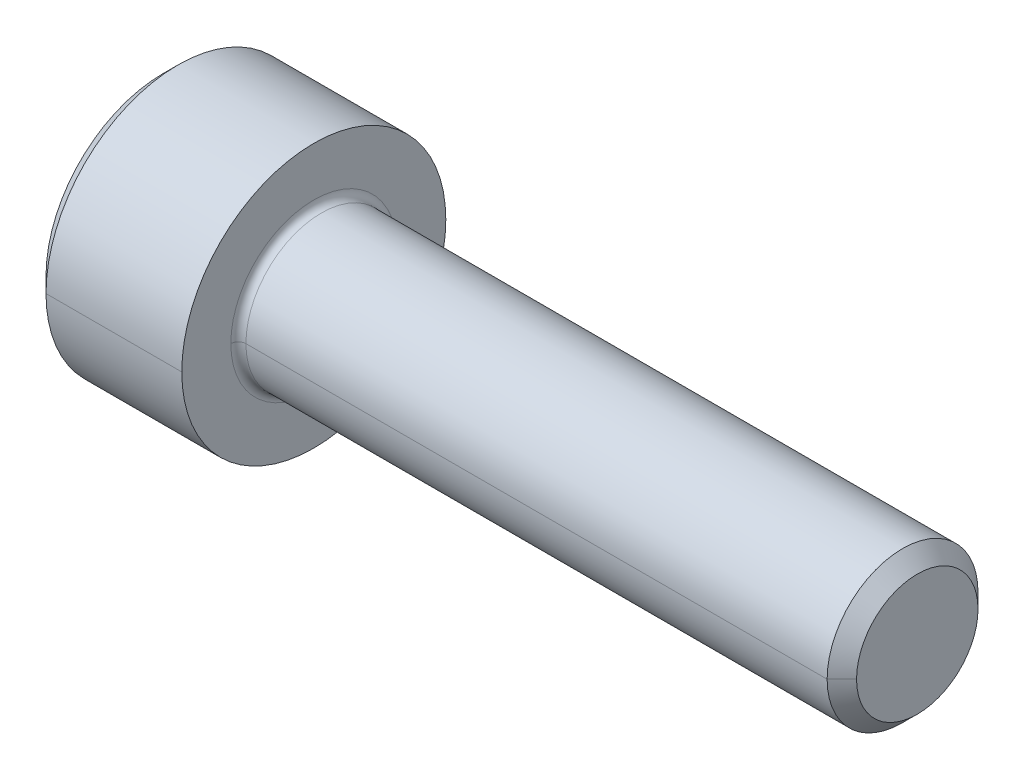
ISO-10303-21;
HEADER;
FILE_DESCRIPTION(('STEP AP214'),'2;1');
FILE_NAME('part.step','',(''),(''),'','','');
FILE_SCHEMA(('AUTOMOTIVE_DESIGN { 1 0 10303 214 1 1 1 1 }'));
ENDSEC;
DATA;
#1=APPLICATION_CONTEXT('core data for automotive mechanical design processes');
#2=APPLICATION_PROTOCOL_DEFINITION('international standard','automotive_design',2000,#1);
#3=PRODUCT_CONTEXT('',#1,'mechanical');
#4=PRODUCT('Part','Part','',(#3));
#5=PRODUCT_RELATED_PRODUCT_CATEGORY('part','',(#4));
#6=PRODUCT_DEFINITION_FORMATION('','',#4);
#7=PRODUCT_DEFINITION_CONTEXT('part definition',#1,'design');
#8=PRODUCT_DEFINITION('design','',#6,#7);
#9=PRODUCT_DEFINITION_SHAPE('','',#8);
#10=(LENGTH_UNIT() NAMED_UNIT(*) SI_UNIT(.MILLI.,.METRE.));
#11=(NAMED_UNIT(*) PLANE_ANGLE_UNIT() SI_UNIT($,.RADIAN.));
#12=(NAMED_UNIT(*) SI_UNIT($,.STERADIAN.) SOLID_ANGLE_UNIT());
#13=UNCERTAINTY_MEASURE_WITH_UNIT(LENGTH_MEASURE(1.E-05),#10,'distance_accuracy_value','');
#14=(GEOMETRIC_REPRESENTATION_CONTEXT(3) GLOBAL_UNCERTAINTY_ASSIGNED_CONTEXT((#13)) GLOBAL_UNIT_ASSIGNED_CONTEXT((#10,
#11,#12)) REPRESENTATION_CONTEXT('',''));
#15=CARTESIAN_POINT('',(0.,0.,0.));
#16=DIRECTION('',(0.,0.,1.));
#17=DIRECTION('',(1.,0.,0.));
#18=AXIS2_PLACEMENT_3D('',#15,#16,#17);
#19=CARTESIAN_POINT('',(2.,0.,0.));
#20=DIRECTION('',(-1.,0.,0.));
#21=DIRECTION('',(0.,0.,1.));
#22=AXIS2_PLACEMENT_3D('',#19,#20,#21);
#23=CONICAL_SURFACE('',#22,1.5355,1.0471975511966);
#24=DIRECTION('',(-0.5,0.,-0.866025403784436));
#25=VECTOR('',#24,1.);
#26=CARTESIAN_POINT('',(2.,0.,-1.5355));
#27=LINE('',#26,#25);
#28=CARTESIAN_POINT('',(2.88652133834068,0.,0.));
#29=VERTEX_POINT('',#28);
#30=CARTESIAN_POINT('',(2.,0.,-1.5355));
#31=VERTEX_POINT('',#30);
#32=EDGE_CURVE('E501',#29,#31,#27,.T.);
#33=ORIENTED_EDGE('',*,*,#32,.F.);
#34=DIRECTION('',(-0.5,0.,0.866025403784436));
#35=VECTOR('',#34,1.);
#36=CARTESIAN_POINT('',(2.,0.,1.5355));
#37=LINE('',#36,#35);
#38=CARTESIAN_POINT('',(2.,0.,1.5355));
#39=VERTEX_POINT('',#38);
#40=EDGE_CURVE('E505',#29,#39,#37,.T.);
#41=ORIENTED_EDGE('',*,*,#40,.T.);
#42=CARTESIAN_POINT('',(2.,0.,0.));
#43=DIRECTION('',(-1.,0.,0.));
#44=DIRECTION('',(0.,0.,1.));
#45=AXIS2_PLACEMENT_3D('',#42,#43,#44);
#46=CIRCLE('',#45,1.5355);
#47=CARTESIAN_POINT('',(2.,1.329782007511,0.76775));
#48=VERTEX_POINT('',#47);
#49=EDGE_CURVE('E228',#39,#48,#46,.T.);
#50=ORIENTED_EDGE('',*,*,#49,.T.);
#51=CARTESIAN_POINT('',(2.,0.,0.));
#52=DIRECTION('',(-1.,0.,0.));
#53=DIRECTION('',(0.,0.,1.));
#54=AXIS2_PLACEMENT_3D('',#51,#52,#53);
#55=CIRCLE('',#54,1.5355);
#56=CARTESIAN_POINT('',(2.,1.329782007511,-0.76775));
#57=VERTEX_POINT('',#56);
#58=EDGE_CURVE('E25',#48,#57,#55,.T.);
#59=ORIENTED_EDGE('',*,*,#58,.T.);
#60=CARTESIAN_POINT('',(2.,0.,0.));
#61=DIRECTION('',(-1.,0.,0.));
#62=DIRECTION('',(0.,0.,1.));
#63=AXIS2_PLACEMENT_3D('',#60,#61,#62);
#64=CIRCLE('',#63,1.5355);
#65=EDGE_CURVE('E11',#57,#31,#64,.T.);
#66=ORIENTED_EDGE('',*,*,#65,.T.);
#67=EDGE_LOOP('',(#33,#41,#50,#59,#66));
#68=FACE_BOUND('',#67,.T.);
#69=ADVANCED_FACE('F16',(#68),#23,.F.);
#70=CARTESIAN_POINT('',(2.,2.65956401502201,-1.5355));
#71=DIRECTION('',(1.,0.,0.));
#72=DIRECTION('',(0.,1.,0.));
#73=AXIS2_PLACEMENT_3D('',#70,#71,#72);
#74=PLANE('',#73);
#75=DIRECTION('',(0.,-0.5,-0.866025403784438));
#76=VECTOR('',#75,1.);
#77=CARTESIAN_POINT('',(2.,1.77304267668133,0.));
#78=LINE('',#77,#76);
#79=CARTESIAN_POINT('',(2.,0.886521338340665,-1.5355));
#80=VERTEX_POINT('',#79);
#81=EDGE_CURVE('E249',#57,#80,#78,.T.);
#82=ORIENTED_EDGE('',*,*,#81,.T.);
#83=DIRECTION('',(0.,-1.,0.));
#84=VECTOR('',#83,1.);
#85=CARTESIAN_POINT('',(2.,0.886521338340665,-1.5355));
#86=LINE('',#85,#84);
#87=EDGE_CURVE('E181',#80,#31,#86,.T.);
#88=ORIENTED_EDGE('',*,*,#87,.T.);
#89=ORIENTED_EDGE('',*,*,#65,.F.);
#90=EDGE_LOOP('',(#82,#88,#89));
#91=FACE_BOUND('',#90,.T.);
#92=ADVANCED_FACE('F331',(#91),#74,.F.);
#93=CARTESIAN_POINT('',(2.,2.65956401502201,-1.5355));
#94=DIRECTION('',(1.,0.,0.));
#95=DIRECTION('',(0.,1.,0.));
#96=AXIS2_PLACEMENT_3D('',#93,#94,#95);
#97=PLANE('',#96);
#98=DIRECTION('',(0.,-0.5,0.86602540378444));
#99=VECTOR('',#98,1.);
#100=CARTESIAN_POINT('',(2.,1.77304267668133,0.));
#101=LINE('',#100,#99);
#102=CARTESIAN_POINT('',(2.,1.77304267668133,0.));
#103=VERTEX_POINT('',#102);
#104=EDGE_CURVE('E195',#103,#48,#101,.T.);
#105=ORIENTED_EDGE('',*,*,#104,.F.);
#106=DIRECTION('',(0.,-0.5,-0.866025403784438));
#107=VECTOR('',#106,1.);
#108=CARTESIAN_POINT('',(2.,1.77304267668133,0.));
#109=LINE('',#108,#107);
#110=EDGE_CURVE('E231',#103,#57,#109,.T.);
#111=ORIENTED_EDGE('',*,*,#110,.T.);
#112=ORIENTED_EDGE('',*,*,#58,.F.);
#113=EDGE_LOOP('',(#105,#111,#112));
#114=FACE_BOUND('',#113,.T.);
#115=ADVANCED_FACE('F245',(#114),#97,.F.);
#116=CARTESIAN_POINT('',(2.,2.65956401502201,-1.5355));
#117=DIRECTION('',(1.,0.,0.));
#118=DIRECTION('',(0.,1.,0.));
#119=AXIS2_PLACEMENT_3D('',#116,#117,#118);
#120=PLANE('',#119);
#121=DIRECTION('',(0.,1.,0.));
#122=VECTOR('',#121,1.);
#123=CARTESIAN_POINT('',(2.,-0.886521338340671,1.5355));
#124=LINE('',#123,#122);
#125=CARTESIAN_POINT('',(2.,0.886521338340669,1.5355));
#126=VERTEX_POINT('',#125);
#127=EDGE_CURVE('E206',#39,#126,#124,.T.);
#128=ORIENTED_EDGE('',*,*,#127,.T.);
#129=DIRECTION('',(0.,-0.5,0.86602540378444));
#130=VECTOR('',#129,1.);
#131=CARTESIAN_POINT('',(2.,1.77304267668133,0.));
#132=LINE('',#131,#130);
#133=EDGE_CURVE('E199',#48,#126,#132,.T.);
#134=ORIENTED_EDGE('',*,*,#133,.F.);
#135=ORIENTED_EDGE('',*,*,#49,.F.);
#136=EDGE_LOOP('',(#128,#134,#135));
#137=FACE_BOUND('',#136,.T.);
#138=ADVANCED_FACE('F340',(#137),#120,.F.);
#139=CARTESIAN_POINT('',(2.,2.65956401502201,-1.5355));
#140=DIRECTION('',(1.,0.,0.));
#141=DIRECTION('',(0.,1.,0.));
#142=AXIS2_PLACEMENT_3D('',#139,#140,#141);
#143=PLANE('',#142);
#144=DIRECTION('',(0.,-0.5,-0.866025403784438));
#145=VECTOR('',#144,1.);
#146=CARTESIAN_POINT('',(2.,-0.886521338340671,1.5355));
#147=LINE('',#146,#145);
#148=CARTESIAN_POINT('',(2.,-0.886521338340671,1.5355));
#149=VERTEX_POINT('',#148);
#150=CARTESIAN_POINT('',(2.,-1.32978200751101,0.76775));
#151=VERTEX_POINT('',#150);
#152=EDGE_CURVE('E216',#149,#151,#147,.T.);
#153=ORIENTED_EDGE('',*,*,#152,.F.);
#154=DIRECTION('',(0.,1.,0.));
#155=VECTOR('',#154,1.);
#156=CARTESIAN_POINT('',(2.,-0.886521338340671,1.5355));
#157=LINE('',#156,#155);
#158=EDGE_CURVE('E207',#149,#39,#157,.T.);
#159=ORIENTED_EDGE('',*,*,#158,.T.);
#160=CARTESIAN_POINT('',(2.,0.,0.));
#161=DIRECTION('',(-1.,0.,0.));
#162=DIRECTION('',(0.,0.,1.));
#163=AXIS2_PLACEMENT_3D('',#160,#161,#162);
#164=CIRCLE('',#163,1.5355);
#165=EDGE_CURVE('E486',#151,#39,#164,.T.);
#166=ORIENTED_EDGE('',*,*,#165,.F.);
#167=EDGE_LOOP('',(#153,#159,#166));
#168=FACE_BOUND('',#167,.T.);
#169=ADVANCED_FACE('F345',(#168),#143,.F.);
#170=CARTESIAN_POINT('',(2.,2.65956401502201,-1.5355));
#171=DIRECTION('',(1.,0.,0.));
#172=DIRECTION('',(0.,1.,0.));
#173=AXIS2_PLACEMENT_3D('',#170,#171,#172);
#174=PLANE('',#173);
#175=DIRECTION('',(0.,0.5,-0.86602540378444));
#176=VECTOR('',#175,1.);
#177=CARTESIAN_POINT('',(2.,-1.77304267668134,0.));
#178=LINE('',#177,#176);
#179=CARTESIAN_POINT('',(2.,-1.77304267668134,0.));
#180=VERTEX_POINT('',#179);
#181=CARTESIAN_POINT('',(2.,-1.32978200751101,-0.76775));
#182=VERTEX_POINT('',#181);
#183=EDGE_CURVE('E88',#180,#182,#178,.T.);
#184=ORIENTED_EDGE('',*,*,#183,.F.);
#185=DIRECTION('',(0.,-0.5,-0.866025403784438));
#186=VECTOR('',#185,1.);
#187=CARTESIAN_POINT('',(2.,-0.886521338340671,1.5355));
#188=LINE('',#187,#186);
#189=EDGE_CURVE('E145',#151,#180,#188,.T.);
#190=ORIENTED_EDGE('',*,*,#189,.F.);
#191=CARTESIAN_POINT('',(2.,0.,0.));
#192=DIRECTION('',(-1.,0.,0.));
#193=DIRECTION('',(0.,0.,1.));
#194=AXIS2_PLACEMENT_3D('',#191,#192,#193);
#195=CIRCLE('',#194,1.5355);
#196=EDGE_CURVE('E494',#182,#151,#195,.T.);
#197=ORIENTED_EDGE('',*,*,#196,.F.);
#198=EDGE_LOOP('',(#184,#190,#197));
#199=FACE_BOUND('',#198,.T.);
#200=ADVANCED_FACE('F349',(#199),#174,.F.);
#201=CARTESIAN_POINT('',(2.,2.65956401502201,-1.5355));
#202=DIRECTION('',(1.,0.,0.));
#203=DIRECTION('',(0.,1.,0.));
#204=AXIS2_PLACEMENT_3D('',#201,#202,#203);
#205=PLANE('',#204);
#206=DIRECTION('',(0.,-1.,0.));
#207=VECTOR('',#206,1.);
#208=CARTESIAN_POINT('',(2.,0.886521338340665,-1.5355));
#209=LINE('',#208,#207);
#210=CARTESIAN_POINT('',(2.,-0.886521338340676,-1.5355));
#211=VERTEX_POINT('',#210);
#212=EDGE_CURVE('E75',#31,#211,#209,.T.);
#213=ORIENTED_EDGE('',*,*,#212,.T.);
#214=DIRECTION('',(0.,0.5,-0.86602540378444));
#215=VECTOR('',#214,1.);
#216=CARTESIAN_POINT('',(2.,-1.77304267668134,0.));
#217=LINE('',#216,#215);
#218=EDGE_CURVE('E223',#182,#211,#217,.T.);
#219=ORIENTED_EDGE('',*,*,#218,.F.);
#220=CARTESIAN_POINT('',(2.,0.,0.));
#221=DIRECTION('',(-1.,0.,0.));
#222=DIRECTION('',(0.,0.,1.));
#223=AXIS2_PLACEMENT_3D('',#220,#221,#222);
#224=CIRCLE('',#223,1.5355);
#225=EDGE_CURVE('E497',#31,#182,#224,.T.);
#226=ORIENTED_EDGE('',*,*,#225,.F.);
#227=EDGE_LOOP('',(#213,#219,#226));
#228=FACE_BOUND('',#227,.T.);
#229=ADVANCED_FACE('F353',(#228),#205,.F.);
#230=CARTESIAN_POINT('',(2.,1.77304267668133,0.));
#231=DIRECTION('',(0.,0.866025403784438,-0.5));
#232=DIRECTION('',(-1.,0.,0.));
#233=AXIS2_PLACEMENT_3D('',#230,#231,#232);
#234=PLANE('',#233);
#235=DIRECTION('',(0.,-0.5,-0.866025403784438));
#236=VECTOR('',#235,1.);
#237=CARTESIAN_POINT('',(0.,1.77304267668133,0.));
#238=LINE('',#237,#236);
#239=CARTESIAN_POINT('',(0.,1.77304267668133,0.));
#240=VERTEX_POINT('',#239);
#241=CARTESIAN_POINT('',(0.,0.886521338340665,-1.5355));
#242=VERTEX_POINT('',#241);
#243=EDGE_CURVE('E177',#240,#242,#238,.T.);
#244=ORIENTED_EDGE('',*,*,#243,.T.);
#245=DIRECTION('',(-1.,0.,0.));
#246=VECTOR('',#245,1.);
#247=CARTESIAN_POINT('',(2.,0.886521338340665,-1.5355));
#248=LINE('',#247,#246);
#249=EDGE_CURVE('E213',#80,#242,#248,.T.);
#250=ORIENTED_EDGE('',*,*,#249,.F.);
#251=ORIENTED_EDGE('',*,*,#81,.F.);
#252=ORIENTED_EDGE('',*,*,#110,.F.);
#253=DIRECTION('',(-1.,0.,0.));
#254=VECTOR('',#253,1.);
#255=CARTESIAN_POINT('',(2.,1.77304267668133,0.));
#256=LINE('',#255,#254);
#257=EDGE_CURVE('E192',#103,#240,#256,.T.);
#258=ORIENTED_EDGE('',*,*,#257,.T.);
#259=EDGE_LOOP('',(#244,#250,#251,#252,#258));
#260=FACE_BOUND('',#259,.T.);
#261=ADVANCED_FACE('F253',(#260),#234,.F.);
#262=CARTESIAN_POINT('',(2.,0.886521338340665,-1.5355));
#263=DIRECTION('',(0.,0.,-1.));
#264=DIRECTION('',(0.,-1.,0.));
#265=AXIS2_PLACEMENT_3D('',#262,#263,#264);
#266=PLANE('',#265);
#267=DIRECTION('',(0.,-1.,0.));
#268=VECTOR('',#267,1.);
#269=CARTESIAN_POINT('',(0.,0.886521338340665,-1.5355));
#270=LINE('',#269,#268);
#271=CARTESIAN_POINT('',(0.,-0.886521338340676,-1.5355));
#272=VERTEX_POINT('',#271);
#273=EDGE_CURVE('E158',#242,#272,#270,.T.);
#274=ORIENTED_EDGE('',*,*,#273,.T.);
#275=DIRECTION('',(-1.,0.,0.));
#276=VECTOR('',#275,1.);
#277=CARTESIAN_POINT('',(2.,-0.886521338340676,-1.5355));
#278=LINE('',#277,#276);
#279=EDGE_CURVE('E153',#211,#272,#278,.T.);
#280=ORIENTED_EDGE('',*,*,#279,.F.);
#281=ORIENTED_EDGE('',*,*,#212,.F.);
#282=ORIENTED_EDGE('',*,*,#87,.F.);
#283=ORIENTED_EDGE('',*,*,#249,.T.);
#284=EDGE_LOOP('',(#274,#280,#281,#282,#283));
#285=FACE_BOUND('',#284,.T.);
#286=ADVANCED_FACE('F356',(#285),#266,.F.);
#287=CARTESIAN_POINT('',(2.,-1.77304267668134,0.));
#288=DIRECTION('',(0.,0.86602540378444,0.5));
#289=DIRECTION('',(1.,0.,0.));
#290=AXIS2_PLACEMENT_3D('',#287,#288,#289);
#291=PLANE('',#290);
#292=DIRECTION('',(0.,0.5,-0.86602540378444));
#293=VECTOR('',#292,1.);
#294=CARTESIAN_POINT('',(0.,-1.77304267668134,0.));
#295=LINE('',#294,#293);
#296=CARTESIAN_POINT('',(0.,-1.77304267668134,0.));
#297=VERTEX_POINT('',#296);
#298=EDGE_CURVE('E150',#297,#272,#295,.T.);
#299=ORIENTED_EDGE('',*,*,#298,.F.);
#300=DIRECTION('',(-1.,0.,0.));
#301=VECTOR('',#300,1.);
#302=CARTESIAN_POINT('',(2.,-1.77304267668134,0.));
#303=LINE('',#302,#301);
#304=EDGE_CURVE('E138',#180,#297,#303,.T.);
#305=ORIENTED_EDGE('',*,*,#304,.F.);
#306=ORIENTED_EDGE('',*,*,#183,.T.);
#307=ORIENTED_EDGE('',*,*,#218,.T.);
#308=ORIENTED_EDGE('',*,*,#279,.T.);
#309=EDGE_LOOP('',(#299,#305,#306,#307,#308));
#310=FACE_BOUND('',#309,.T.);
#311=ADVANCED_FACE('F151',(#310),#291,.T.);
#312=CARTESIAN_POINT('',(2.,-0.886521338340671,1.5355));
#313=DIRECTION('',(0.,0.866025403784438,-0.5));
#314=DIRECTION('',(-1.,0.,0.));
#315=AXIS2_PLACEMENT_3D('',#312,#313,#314);
#316=PLANE('',#315);
#317=DIRECTION('',(0.,-0.5,-0.866025403784438));
#318=VECTOR('',#317,1.);
#319=CARTESIAN_POINT('',(0.,-0.886521338340671,1.5355));
#320=LINE('',#319,#318);
#321=CARTESIAN_POINT('',(0.,-0.886521338340671,1.5355));
#322=VERTEX_POINT('',#321);
#323=EDGE_CURVE('E142',#322,#297,#320,.T.);
#324=ORIENTED_EDGE('',*,*,#323,.F.);
#325=DIRECTION('',(-1.,0.,0.));
#326=VECTOR('',#325,1.);
#327=CARTESIAN_POINT('',(2.,-0.886521338340671,1.5355));
#328=LINE('',#327,#326);
#329=EDGE_CURVE('E131',#149,#322,#328,.T.);
#330=ORIENTED_EDGE('',*,*,#329,.F.);
#331=ORIENTED_EDGE('',*,*,#152,.T.);
#332=ORIENTED_EDGE('',*,*,#189,.T.);
#333=ORIENTED_EDGE('',*,*,#304,.T.);
#334=EDGE_LOOP('',(#324,#330,#331,#332,#333));
#335=FACE_BOUND('',#334,.T.);
#336=ADVANCED_FACE('F140',(#335),#316,.T.);
#337=CARTESIAN_POINT('',(2.,-0.886521338340671,1.5355));
#338=DIRECTION('',(0.,0.,1.));
#339=DIRECTION('',(0.,-1.,0.));
#340=AXIS2_PLACEMENT_3D('',#337,#338,#339);
#341=PLANE('',#340);
#342=DIRECTION('',(0.,1.,0.));
#343=VECTOR('',#342,1.);
#344=CARTESIAN_POINT('',(0.,-0.886521338340671,1.5355));
#345=LINE('',#344,#343);
#346=CARTESIAN_POINT('',(0.,0.886521338340669,1.5355));
#347=VERTEX_POINT('',#346);
#348=EDGE_CURVE('E163',#322,#347,#345,.T.);
#349=ORIENTED_EDGE('',*,*,#348,.T.);
#350=DIRECTION('',(-1.,0.,0.));
#351=VECTOR('',#350,1.);
#352=CARTESIAN_POINT('',(2.,0.886521338340669,1.5355));
#353=LINE('',#352,#351);
#354=EDGE_CURVE('E203',#126,#347,#353,.T.);
#355=ORIENTED_EDGE('',*,*,#354,.F.);
#356=ORIENTED_EDGE('',*,*,#127,.F.);
#357=ORIENTED_EDGE('',*,*,#158,.F.);
#358=ORIENTED_EDGE('',*,*,#329,.T.);
#359=EDGE_LOOP('',(#349,#355,#356,#357,#358));
#360=FACE_BOUND('',#359,.T.);
#361=ADVANCED_FACE('F316',(#360),#341,.F.);
#362=CARTESIAN_POINT('',(2.,1.77304267668133,0.));
#363=DIRECTION('',(0.,-0.86602540378444,-0.5));
#364=DIRECTION('',(0.,0.5,-0.86602540378444));
#365=AXIS2_PLACEMENT_3D('',#362,#363,#364);
#366=PLANE('',#365);
#367=DIRECTION('',(0.,-0.5,0.86602540378444));
#368=VECTOR('',#367,1.);
#369=CARTESIAN_POINT('',(0.,1.77304267668133,0.));
#370=LINE('',#369,#368);
#371=EDGE_CURVE('E170',#240,#347,#370,.T.);
#372=ORIENTED_EDGE('',*,*,#371,.F.);
#373=ORIENTED_EDGE('',*,*,#257,.F.);
#374=ORIENTED_EDGE('',*,*,#104,.T.);
#375=ORIENTED_EDGE('',*,*,#133,.T.);
#376=ORIENTED_EDGE('',*,*,#354,.T.);
#377=EDGE_LOOP('',(#372,#373,#374,#375,#376));
#378=FACE_BOUND('',#377,.T.);
#379=ADVANCED_FACE('F313',(#378),#366,.T.);
#380=CARTESIAN_POINT('',(4.2,0.,0.));
#381=DIRECTION('',(1.,0.,0.));
#382=DIRECTION('',(0.,0.,-1.));
#383=AXIS2_PLACEMENT_3D('',#380,#381,#382);
#384=TOROIDAL_SURFACE('',#383,2.19999999999997,0.2);
#385=CARTESIAN_POINT('',(4.2,0.,2.19999999999997));
#386=DIRECTION('',(0.,1.,0.));
#387=DIRECTION('',(0.,0.,1.));
#388=AXIS2_PLACEMENT_3D('',#385,#386,#387);
#389=CIRCLE('',#388,0.2);
#390=CARTESIAN_POINT('',(4.2,0.,1.99999999999997));
#391=VERTEX_POINT('',#390);
#392=CARTESIAN_POINT('',(4.,0.,2.19999999999997));
#393=VERTEX_POINT('',#392);
#394=EDGE_CURVE('E477',#391,#393,#389,.T.);
#395=ORIENTED_EDGE('',*,*,#394,.F.);
#396=CARTESIAN_POINT('',(4.2,0.,0.));
#397=DIRECTION('',(1.,0.,0.));
#398=DIRECTION('',(0.,0.,-1.));
#399=AXIS2_PLACEMENT_3D('',#396,#397,#398);
#400=CIRCLE('',#399,1.99999999999997);
#401=CARTESIAN_POINT('',(4.2,0.,-1.99999999999997));
#402=VERTEX_POINT('',#401);
#403=EDGE_CURVE('E279',#402,#391,#400,.T.);
#404=ORIENTED_EDGE('',*,*,#403,.F.);
#405=CARTESIAN_POINT('',(4.2,0.,-2.19999999999997));
#406=DIRECTION('',(0.,-1.,0.));
#407=DIRECTION('',(0.,0.,-1.));
#408=AXIS2_PLACEMENT_3D('',#405,#406,#407);
#409=CIRCLE('',#408,0.2);
#410=CARTESIAN_POINT('',(4.,0.,-2.19999999999997));
#411=VERTEX_POINT('',#410);
#412=EDGE_CURVE('E465',#402,#411,#409,.T.);
#413=ORIENTED_EDGE('',*,*,#412,.T.);
#414=CARTESIAN_POINT('',(4.,0.,0.));
#415=DIRECTION('',(-1.,0.,0.));
#416=DIRECTION('',(0.,0.,-1.));
#417=AXIS2_PLACEMENT_3D('',#414,#415,#416);
#418=CIRCLE('',#417,2.19999999999997);
#419=EDGE_CURVE('E187',#393,#411,#418,.T.);
#420=ORIENTED_EDGE('',*,*,#419,.F.);
#421=EDGE_LOOP('',(#395,#404,#413,#420));
#422=FACE_BOUND('',#421,.T.);
#423=ADVANCED_FACE('F325',(#422),#384,.F.);
#424=CARTESIAN_POINT('',(0.,0.,0.));
#425=DIRECTION('',(1.,0.,0.));
#426=DIRECTION('',(0.,0.,-1.));
#427=AXIS2_PLACEMENT_3D('',#424,#425,#426);
#428=CONICAL_SURFACE('',#427,3.1,0.78539816339745);
#429=DIRECTION('',(0.707106781186546,0.,0.707106781186549));
#430=VECTOR('',#429,1.);
#431=CARTESIAN_POINT('',(0.,0.,3.1));
#432=LINE('',#431,#430);
#433=CARTESIAN_POINT('',(0.,0.,3.1));
#434=VERTEX_POINT('',#433);
#435=CARTESIAN_POINT('',(0.4,0.,3.5));
#436=VERTEX_POINT('',#435);
#437=EDGE_CURVE('E456',#434,#436,#432,.T.);
#438=ORIENTED_EDGE('',*,*,#437,.F.);
#439=CARTESIAN_POINT('',(0.,0.,0.));
#440=DIRECTION('',(-1.,0.,0.));
#441=DIRECTION('',(0.,0.,1.));
#442=AXIS2_PLACEMENT_3D('',#439,#440,#441);
#443=CIRCLE('',#442,3.1);
#444=CARTESIAN_POINT('',(0.,0.,-3.1));
#445=VERTEX_POINT('',#444);
#446=EDGE_CURVE('E303',#445,#434,#443,.T.);
#447=ORIENTED_EDGE('',*,*,#446,.F.);
#448=DIRECTION('',(0.707106781186546,0.,-0.707106781186549));
#449=VECTOR('',#448,1.);
#450=CARTESIAN_POINT('',(0.,0.,-3.1));
#451=LINE('',#450,#449);
#452=CARTESIAN_POINT('',(0.4,0.,-3.5));
#453=VERTEX_POINT('',#452);
#454=EDGE_CURVE('E269',#445,#453,#451,.T.);
#455=ORIENTED_EDGE('',*,*,#454,.T.);
#456=CARTESIAN_POINT('',(0.4,0.,0.));
#457=DIRECTION('',(-1.,0.,0.));
#458=DIRECTION('',(0.,0.,1.));
#459=AXIS2_PLACEMENT_3D('',#456,#457,#458);
#460=CIRCLE('',#459,3.5);
#461=EDGE_CURVE('E188',#453,#436,#460,.T.);
#462=ORIENTED_EDGE('',*,*,#461,.T.);
#463=EDGE_LOOP('',(#438,#447,#455,#462));
#464=FACE_BOUND('',#463,.T.);
#465=ADVANCED_FACE('F365',(#464),#428,.T.);
#466=CARTESIAN_POINT('',(-31.75,0.,0.));
#467=DIRECTION('',(-1.,0.,0.));
#468=DIRECTION('',(0.,0.,1.));
#469=AXIS2_PLACEMENT_3D('',#466,#467,#468);
#470=CYLINDRICAL_SURFACE('',#469,3.5);
#471=DIRECTION('',(-1.,0.,0.));
#472=VECTOR('',#471,1.);
#473=CARTESIAN_POINT('',(-31.75,0.,-3.5));
#474=LINE('',#473,#472);
#475=CARTESIAN_POINT('',(4.,0.,-3.5));
#476=VERTEX_POINT('',#475);
#477=EDGE_CURVE('E263',#476,#453,#474,.T.);
#478=ORIENTED_EDGE('',*,*,#477,.F.);
#479=CARTESIAN_POINT('',(4.,0.,0.));
#480=DIRECTION('',(-1.,0.,0.));
#481=DIRECTION('',(0.,0.,1.));
#482=AXIS2_PLACEMENT_3D('',#479,#480,#481);
#483=CIRCLE('',#482,3.5);
#484=CARTESIAN_POINT('',(4.,0.,3.5));
#485=VERTEX_POINT('',#484);
#486=EDGE_CURVE('E184',#476,#485,#483,.T.);
#487=ORIENTED_EDGE('',*,*,#486,.T.);
#488=DIRECTION('',(-1.,0.,0.));
#489=VECTOR('',#488,1.);
#490=CARTESIAN_POINT('',(-31.75,0.,3.5));
#491=LINE('',#490,#489);
#492=EDGE_CURVE('E270',#485,#436,#491,.T.);
#493=ORIENTED_EDGE('',*,*,#492,.T.);
#494=ORIENTED_EDGE('',*,*,#461,.F.);
#495=EDGE_LOOP('',(#478,#487,#493,#494));
#496=FACE_BOUND('',#495,.T.);
#497=ADVANCED_FACE('F368',(#496),#470,.T.);
#498=CARTESIAN_POINT('',(4.,3.5,0.));
#499=DIRECTION('',(1.,0.,0.));
#500=DIRECTION('',(0.,1.,0.));
#501=AXIS2_PLACEMENT_3D('',#498,#499,#500);
#502=PLANE('',#501);
#503=CARTESIAN_POINT('',(4.,0.,0.));
#504=DIRECTION('',(-1.,0.,0.));
#505=DIRECTION('',(0.,0.,-1.));
#506=AXIS2_PLACEMENT_3D('',#503,#504,#505);
#507=CIRCLE('',#506,2.19999999999997);
#508=EDGE_CURVE('E472',#411,#393,#507,.T.);
#509=ORIENTED_EDGE('',*,*,#508,.T.);
#510=ORIENTED_EDGE('',*,*,#419,.T.);
#511=EDGE_LOOP('',(#509,#510));
#512=FACE_BOUND('',#511,.T.);
#513=CARTESIAN_POINT('',(4.,0.,0.));
#514=DIRECTION('',(-1.,0.,0.));
#515=DIRECTION('',(0.,0.,1.));
#516=AXIS2_PLACEMENT_3D('',#513,#514,#515);
#517=CIRCLE('',#516,3.5);
#518=EDGE_CURVE('E265',#485,#476,#517,.T.);
#519=ORIENTED_EDGE('',*,*,#518,.F.);
#520=ORIENTED_EDGE('',*,*,#486,.F.);
#521=EDGE_LOOP('',(#519,#520));
#522=FACE_BOUND('',#521,.T.);
#523=ADVANCED_FACE('F371',(#512,#522),#502,.T.);
#524=CARTESIAN_POINT('',(-31.75,0.,0.));
#525=DIRECTION('',(-1.,0.,0.));
#526=DIRECTION('',(0.,0.,1.));
#527=AXIS2_PLACEMENT_3D('',#524,#525,#526);
#528=CYLINDRICAL_SURFACE('',#527,1.99999999999997);
#529=DIRECTION('',(-1.,0.,0.));
#530=VECTOR('',#529,1.);
#531=CARTESIAN_POINT('',(-31.75,0.,-1.99999999999997));
#532=LINE('',#531,#530);
#533=CARTESIAN_POINT('',(19.61,0.,-1.99999999999994));
#534=VERTEX_POINT('',#533);
#535=EDGE_CURVE('E275',#534,#402,#532,.T.);
#536=ORIENTED_EDGE('',*,*,#535,.F.);
#537=CARTESIAN_POINT('',(19.61,0.,0.));
#538=DIRECTION('',(-1.,0.,0.));
#539=DIRECTION('',(0.,0.,1.));
#540=AXIS2_PLACEMENT_3D('',#537,#538,#539);
#541=CIRCLE('',#540,1.99999999999994);
#542=CARTESIAN_POINT('',(19.61,0.,1.99999999999994));
#543=VERTEX_POINT('',#542);
#544=EDGE_CURVE('E176',#534,#543,#541,.T.);
#545=ORIENTED_EDGE('',*,*,#544,.T.);
#546=DIRECTION('',(-1.,0.,0.));
#547=VECTOR('',#546,1.);
#548=CARTESIAN_POINT('',(-31.75,0.,1.99999999999997));
#549=LINE('',#548,#547);
#550=EDGE_CURVE('E283',#543,#391,#549,.T.);
#551=ORIENTED_EDGE('',*,*,#550,.T.);
#552=CARTESIAN_POINT('',(4.2,0.,0.));
#553=DIRECTION('',(1.,0.,0.));
#554=DIRECTION('',(0.,0.,-1.));
#555=AXIS2_PLACEMENT_3D('',#552,#553,#554);
#556=CIRCLE('',#555,1.99999999999997);
#557=EDGE_CURVE('E405',#391,#402,#556,.T.);
#558=ORIENTED_EDGE('',*,*,#557,.T.);
#559=EDGE_LOOP('',(#536,#545,#551,#558));
#560=FACE_BOUND('',#559,.T.);
#561=ADVANCED_FACE('F375',(#560),#528,.T.);
#562=CARTESIAN_POINT('',(20.,0.,0.));
#563=DIRECTION('',(-1.,0.,0.));
#564=DIRECTION('',(0.,0.,1.));
#565=AXIS2_PLACEMENT_3D('',#562,#563,#564);
#566=CONICAL_SURFACE('',#565,1.61,0.785398163397317);
#567=DIRECTION('',(-0.707106781186641,0.,-0.707106781186455));
#568=VECTOR('',#567,1.);
#569=CARTESIAN_POINT('',(20.,0.,-1.61));
#570=LINE('',#569,#568);
#571=CARTESIAN_POINT('',(20.,0.,-1.61));
#572=VERTEX_POINT('',#571);
#573=EDGE_CURVE('E294',#572,#534,#570,.T.);
#574=ORIENTED_EDGE('',*,*,#573,.F.);
#575=CARTESIAN_POINT('',(20.,0.,0.));
#576=DIRECTION('',(-1.,0.,0.));
#577=DIRECTION('',(0.,0.,1.));
#578=AXIS2_PLACEMENT_3D('',#575,#576,#577);
#579=CIRCLE('',#578,1.61);
#580=CARTESIAN_POINT('',(20.,0.,1.61));
#581=VERTEX_POINT('',#580);
#582=EDGE_CURVE('E174',#572,#581,#579,.T.);
#583=ORIENTED_EDGE('',*,*,#582,.T.);
#584=DIRECTION('',(-0.707106781186641,0.,0.707106781186455));
#585=VECTOR('',#584,1.);
#586=CARTESIAN_POINT('',(20.,0.,1.61));
#587=LINE('',#586,#585);
#588=EDGE_CURVE('E300',#581,#543,#587,.T.);
#589=ORIENTED_EDGE('',*,*,#588,.T.);
#590=ORIENTED_EDGE('',*,*,#544,.F.);
#591=EDGE_LOOP('',(#574,#583,#589,#590));
#592=FACE_BOUND('',#591,.T.);
#593=ADVANCED_FACE('F377',(#592),#566,.T.);
#594=CARTESIAN_POINT('',(20.,1.61,0.));
#595=DIRECTION('',(1.,0.,0.));
#596=DIRECTION('',(0.,1.,0.));
#597=AXIS2_PLACEMENT_3D('',#594,#595,#596);
#598=PLANE('',#597);
#599=CARTESIAN_POINT('',(20.,0.,0.));
#600=DIRECTION('',(-1.,0.,0.));
#601=DIRECTION('',(0.,0.,1.));
#602=AXIS2_PLACEMENT_3D('',#599,#600,#601);
#603=CIRCLE('',#602,1.61);
#604=EDGE_CURVE('E287',#581,#572,#603,.T.);
#605=ORIENTED_EDGE('',*,*,#604,.F.);
#606=ORIENTED_EDGE('',*,*,#582,.F.);
#607=EDGE_LOOP('',(#605,#606));
#608=FACE_BOUND('',#607,.T.);
#609=ADVANCED_FACE('F379',(#608),#598,.T.);
#610=CARTESIAN_POINT('',(0.,0.,0.));
#611=DIRECTION('',(-1.,0.,0.));
#612=DIRECTION('',(0.,0.,1.));
#613=AXIS2_PLACEMENT_3D('',#610,#611,#612);
#614=PLANE('',#613);
#615=ORIENTED_EDGE('',*,*,#371,.T.);
#616=ORIENTED_EDGE('',*,*,#348,.F.);
#617=ORIENTED_EDGE('',*,*,#323,.T.);
#618=ORIENTED_EDGE('',*,*,#298,.T.);
#619=ORIENTED_EDGE('',*,*,#273,.F.);
#620=ORIENTED_EDGE('',*,*,#243,.F.);
#621=EDGE_LOOP('',(#615,#616,#617,#618,#619,#620));
#622=FACE_BOUND('',#621,.T.);
#623=ORIENTED_EDGE('',*,*,#446,.T.);
#624=CARTESIAN_POINT('',(0.,0.,0.));
#625=DIRECTION('',(-1.,0.,0.));
#626=DIRECTION('',(0.,0.,1.));
#627=AXIS2_PLACEMENT_3D('',#624,#625,#626);
#628=CIRCLE('',#627,3.1);
#629=EDGE_CURVE('E461',#434,#445,#628,.T.);
#630=ORIENTED_EDGE('',*,*,#629,.T.);
#631=EDGE_LOOP('',(#623,#630));
#632=FACE_BOUND('',#631,.T.);
#633=ADVANCED_FACE('F161',(#622,#632),#614,.T.);
#634=CARTESIAN_POINT('',(20.,0.,0.));
#635=DIRECTION('',(-1.,0.,0.));
#636=DIRECTION('',(0.,0.,1.));
#637=AXIS2_PLACEMENT_3D('',#634,#635,#636);
#638=CONICAL_SURFACE('',#637,1.61,0.785398163397317);
#639=ORIENTED_EDGE('',*,*,#604,.T.);
#640=ORIENTED_EDGE('',*,*,#573,.T.);
#641=CARTESIAN_POINT('',(19.61,0.,0.));
#642=DIRECTION('',(-1.,0.,0.));
#643=DIRECTION('',(0.,0.,1.));
#644=AXIS2_PLACEMENT_3D('',#641,#642,#643);
#645=CIRCLE('',#644,1.99999999999994);
#646=EDGE_CURVE('E274',#543,#534,#645,.T.);
#647=ORIENTED_EDGE('',*,*,#646,.F.);
#648=ORIENTED_EDGE('',*,*,#588,.F.);
#649=EDGE_LOOP('',(#639,#640,#647,#648));
#650=FACE_BOUND('',#649,.T.);
#651=ADVANCED_FACE('F387',(#650),#638,.T.);
#652=CARTESIAN_POINT('',(-31.75,0.,0.));
#653=DIRECTION('',(-1.,0.,0.));
#654=DIRECTION('',(0.,0.,1.));
#655=AXIS2_PLACEMENT_3D('',#652,#653,#654);
#656=CYLINDRICAL_SURFACE('',#655,1.99999999999997);
#657=ORIENTED_EDGE('',*,*,#646,.T.);
#658=ORIENTED_EDGE('',*,*,#535,.T.);
#659=ORIENTED_EDGE('',*,*,#403,.T.);
#660=ORIENTED_EDGE('',*,*,#550,.F.);
#661=EDGE_LOOP('',(#657,#658,#659,#660));
#662=FACE_BOUND('',#661,.T.);
#663=ADVANCED_FACE('F397',(#662),#656,.T.);
#664=CARTESIAN_POINT('',(-31.75,0.,0.));
#665=DIRECTION('',(-1.,0.,0.));
#666=DIRECTION('',(0.,0.,1.));
#667=AXIS2_PLACEMENT_3D('',#664,#665,#666);
#668=CYLINDRICAL_SURFACE('',#667,3.5);
#669=ORIENTED_EDGE('',*,*,#518,.T.);
#670=ORIENTED_EDGE('',*,*,#477,.T.);
#671=CARTESIAN_POINT('',(0.4,0.,0.));
#672=DIRECTION('',(-1.,0.,0.));
#673=DIRECTION('',(0.,0.,1.));
#674=AXIS2_PLACEMENT_3D('',#671,#672,#673);
#675=CIRCLE('',#674,3.5);
#676=EDGE_CURVE('E445',#436,#453,#675,.T.);
#677=ORIENTED_EDGE('',*,*,#676,.F.);
#678=ORIENTED_EDGE('',*,*,#492,.F.);
#679=EDGE_LOOP('',(#669,#670,#677,#678));
#680=FACE_BOUND('',#679,.T.);
#681=ADVANCED_FACE('F443',(#680),#668,.T.);
#682=CARTESIAN_POINT('',(0.,0.,0.));
#683=DIRECTION('',(1.,0.,0.));
#684=DIRECTION('',(0.,0.,-1.));
#685=AXIS2_PLACEMENT_3D('',#682,#683,#684);
#686=CONICAL_SURFACE('',#685,3.1,0.78539816339745);
#687=ORIENTED_EDGE('',*,*,#629,.F.);
#688=ORIENTED_EDGE('',*,*,#437,.T.);
#689=ORIENTED_EDGE('',*,*,#676,.T.);
#690=ORIENTED_EDGE('',*,*,#454,.F.);
#691=EDGE_LOOP('',(#687,#688,#689,#690));
#692=FACE_BOUND('',#691,.T.);
#693=ADVANCED_FACE('F460',(#692),#686,.T.);
#694=CARTESIAN_POINT('',(4.2,0.,0.));
#695=DIRECTION('',(1.,0.,0.));
#696=DIRECTION('',(0.,0.,-1.));
#697=AXIS2_PLACEMENT_3D('',#694,#695,#696);
#698=TOROIDAL_SURFACE('',#697,2.19999999999997,0.2);
#699=ORIENTED_EDGE('',*,*,#557,.F.);
#700=ORIENTED_EDGE('',*,*,#394,.T.);
#701=ORIENTED_EDGE('',*,*,#508,.F.);
#702=ORIENTED_EDGE('',*,*,#412,.F.);
#703=EDGE_LOOP('',(#699,#700,#701,#702));
#704=FACE_BOUND('',#703,.T.);
#705=ADVANCED_FACE('F533',(#704),#698,.F.);
#706=CARTESIAN_POINT('',(2.,0.,0.));
#707=DIRECTION('',(-1.,0.,0.));
#708=DIRECTION('',(0.,0.,1.));
#709=AXIS2_PLACEMENT_3D('',#706,#707,#708);
#710=CONICAL_SURFACE('',#709,1.5355,1.0471975511966);
#711=ORIENTED_EDGE('',*,*,#40,.F.);
#712=ORIENTED_EDGE('',*,*,#32,.T.);
#713=ORIENTED_EDGE('',*,*,#225,.T.);
#714=ORIENTED_EDGE('',*,*,#196,.T.);
#715=ORIENTED_EDGE('',*,*,#165,.T.);
#716=EDGE_LOOP('',(#711,#712,#713,#714,#715));
#717=FACE_BOUND('',#716,.T.);
#718=ADVANCED_FACE('F514',(#717),#710,.F.);
#719=CLOSED_SHELL('',(#69,#92,#115,#138,#169,#200,#229,#261,#286,#311,#336,#361,#379,#423,#465,
#497,#523,#561,#593,#609,#633,#651,#663,#681,#693,#705,#718));
#720=MANIFOLD_SOLID_BREP('B1',#719);
#721=ADVANCED_BREP_SHAPE_REPRESENTATION('',(#18,#720),#14);
#722=SHAPE_DEFINITION_REPRESENTATION(#9,#721);
ENDSEC;
END-ISO-10303-21;
